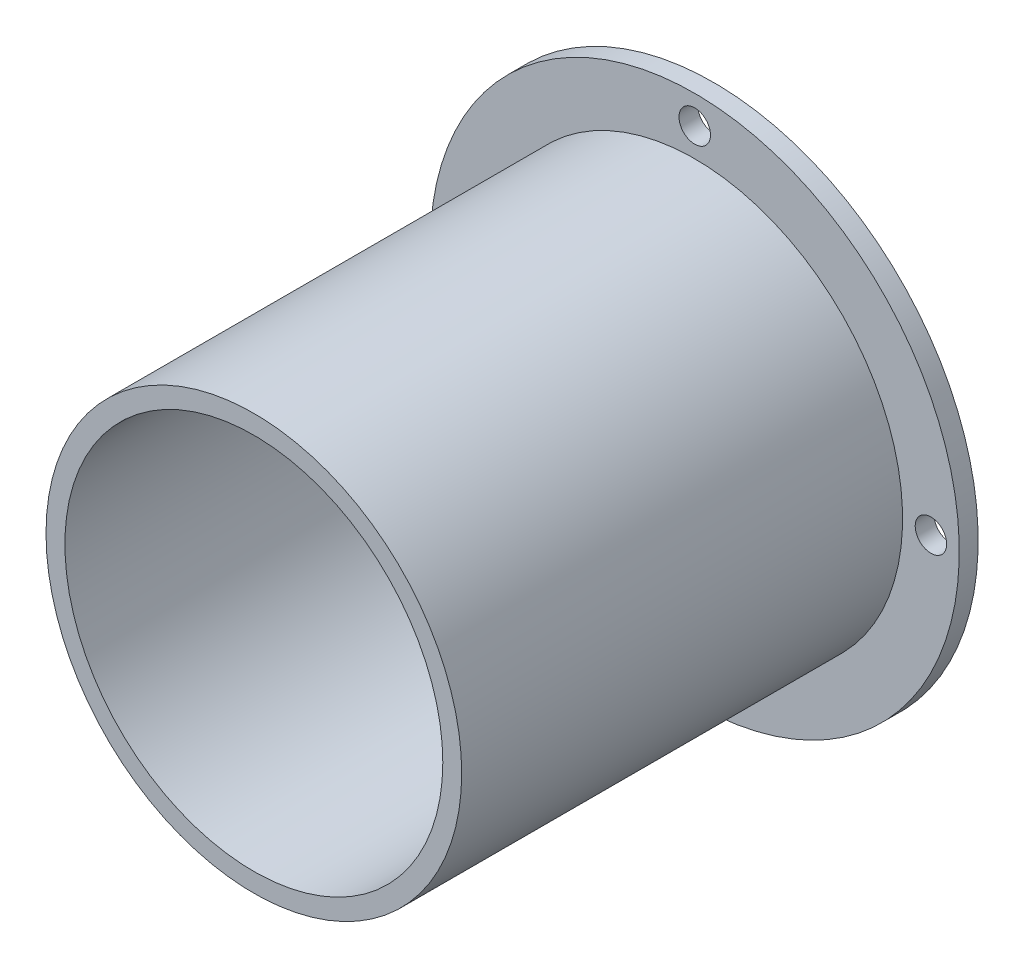
ISO-10303-21;
HEADER;
FILE_DESCRIPTION(('STEP AP214'),'2;1');
FILE_NAME('part.step','',(''),(''),'','','');
FILE_SCHEMA(('AUTOMOTIVE_DESIGN { 1 0 10303 214 1 1 1 1 }'));
ENDSEC;
DATA;
#1=APPLICATION_CONTEXT('core data for automotive mechanical design processes');
#2=APPLICATION_PROTOCOL_DEFINITION('international standard','automotive_design',2000,#1);
#3=PRODUCT_CONTEXT('',#1,'mechanical');
#4=PRODUCT('Part','Part','',(#3));
#5=PRODUCT_RELATED_PRODUCT_CATEGORY('part','',(#4));
#6=PRODUCT_DEFINITION_FORMATION('','',#4);
#7=PRODUCT_DEFINITION_CONTEXT('part definition',#1,'design');
#8=PRODUCT_DEFINITION('design','',#6,#7);
#9=PRODUCT_DEFINITION_SHAPE('','',#8);
#10=(LENGTH_UNIT() NAMED_UNIT(*) SI_UNIT(.MILLI.,.METRE.));
#11=(NAMED_UNIT(*) PLANE_ANGLE_UNIT() SI_UNIT($,.RADIAN.));
#12=(NAMED_UNIT(*) SI_UNIT($,.STERADIAN.) SOLID_ANGLE_UNIT());
#13=UNCERTAINTY_MEASURE_WITH_UNIT(LENGTH_MEASURE(1.E-05),#10,'distance_accuracy_value','');
#14=(GEOMETRIC_REPRESENTATION_CONTEXT(3) GLOBAL_UNCERTAINTY_ASSIGNED_CONTEXT((#13)) GLOBAL_UNIT_ASSIGNED_CONTEXT((#10,
#11,#12)) REPRESENTATION_CONTEXT('',''));
#15=CARTESIAN_POINT('',(0.,0.,0.));
#16=DIRECTION('',(0.,0.,1.));
#17=DIRECTION('',(1.,0.,0.));
#18=AXIS2_PLACEMENT_3D('',#15,#16,#17);
#19=CARTESIAN_POINT('',(0.,0.,-3.5));
#20=DIRECTION('',(0.,0.,-1.));
#21=DIRECTION('',(-1.,0.,0.));
#22=AXIS2_PLACEMENT_3D('',#19,#20,#21);
#23=PLANE('',#22);
#24=CARTESIAN_POINT('',(-9.8556991912404E-13,-18.75,-3.5));
#25=DIRECTION('',(0.,0.,-1.));
#26=DIRECTION('',(-1.,0.,0.));
#27=AXIS2_PLACEMENT_3D('',#24,#25,#26);
#28=CIRCLE('',#27,1.25);
#29=CARTESIAN_POINT('',(-1.25000000000099,-18.75,-3.5));
#30=VERTEX_POINT('',#29);
#31=EDGE_CURVE('E73',#30,#30,#28,.T.);
#32=ORIENTED_EDGE('',*,*,#31,.F.);
#33=EDGE_LOOP('',(#32));
#34=FACE_BOUND('',#33,.T.);
#35=CARTESIAN_POINT('',(0.,18.75,-3.5));
#36=DIRECTION('',(0.,0.,-1.));
#37=DIRECTION('',(-1.,0.,0.));
#38=AXIS2_PLACEMENT_3D('',#35,#36,#37);
#39=CIRCLE('',#38,1.25);
#40=CARTESIAN_POINT('',(-1.25,18.75,-3.5));
#41=VERTEX_POINT('',#40);
#42=EDGE_CURVE('E61',#41,#41,#39,.T.);
#43=ORIENTED_EDGE('',*,*,#42,.F.);
#44=EDGE_LOOP('',(#43));
#45=FACE_BOUND('',#44,.T.);
#46=CARTESIAN_POINT('',(0.,0.,-3.5));
#47=DIRECTION('',(0.,0.,-1.));
#48=DIRECTION('',(-1.,0.,0.));
#49=AXIS2_PLACEMENT_3D('',#46,#47,#48);
#50=CIRCLE('',#49,21.);
#51=CARTESIAN_POINT('',(-21.,0.,-3.5));
#52=VERTEX_POINT('',#51);
#53=EDGE_CURVE('E11',#52,#52,#50,.T.);
#54=ORIENTED_EDGE('',*,*,#53,.T.);
#55=EDGE_LOOP('',(#54));
#56=FACE_BOUND('',#55,.T.);
#57=CARTESIAN_POINT('',(0.,0.,-3.5));
#58=DIRECTION('',(0.,0.,-1.));
#59=DIRECTION('',(-1.,0.,0.));
#60=AXIS2_PLACEMENT_3D('',#57,#58,#59);
#61=CIRCLE('',#60,16.5);
#62=CARTESIAN_POINT('',(-16.5,0.,-3.5));
#63=VERTEX_POINT('',#62);
#64=EDGE_CURVE('E56',#63,#63,#61,.T.);
#65=ORIENTED_EDGE('',*,*,#64,.F.);
#66=EDGE_LOOP('',(#65));
#67=FACE_BOUND('',#66,.T.);
#68=CARTESIAN_POINT('',(-18.7500000000005,4.9278495956202E-13,-3.5));
#69=DIRECTION('',(0.,0.,-1.));
#70=DIRECTION('',(-1.,0.,0.));
#71=AXIS2_PLACEMENT_3D('',#68,#69,#70);
#72=CIRCLE('',#71,1.25);
#73=CARTESIAN_POINT('',(-20.0000000000005,4.9278495956202E-13,-3.5));
#74=VERTEX_POINT('',#73);
#75=EDGE_CURVE('E67',#74,#74,#72,.T.);
#76=ORIENTED_EDGE('',*,*,#75,.F.);
#77=EDGE_LOOP('',(#76));
#78=FACE_BOUND('',#77,.T.);
#79=CARTESIAN_POINT('',(18.7499999999995,-4.95081172310421E-13,-3.5));
#80=DIRECTION('',(0.,0.,-1.));
#81=DIRECTION('',(-1.,0.,0.));
#82=AXIS2_PLACEMENT_3D('',#79,#80,#81);
#83=CIRCLE('',#82,1.25);
#84=CARTESIAN_POINT('',(17.4999999999995,-4.95081172310421E-13,-3.5));
#85=VERTEX_POINT('',#84);
#86=EDGE_CURVE('E79',#85,#85,#83,.T.);
#87=ORIENTED_EDGE('',*,*,#86,.F.);
#88=EDGE_LOOP('',(#87));
#89=FACE_BOUND('',#88,.T.);
#90=ADVANCED_FACE('F45',(#34,#45,#56,#67,#78,#89),#23,.T.);
#91=CARTESIAN_POINT('',(0.,0.,-2.));
#92=DIRECTION('',(0.,0.,-1.));
#93=DIRECTION('',(-1.,0.,0.));
#94=AXIS2_PLACEMENT_3D('',#91,#92,#93);
#95=PLANE('',#94);
#96=CARTESIAN_POINT('',(0.,0.,-2.));
#97=DIRECTION('',(0.,0.,-1.));
#98=DIRECTION('',(-1.,0.,0.));
#99=AXIS2_PLACEMENT_3D('',#96,#97,#98);
#100=CIRCLE('',#99,21.);
#101=CARTESIAN_POINT('',(-21.,0.,-2.));
#102=VERTEX_POINT('',#101);
#103=EDGE_CURVE('E49',#102,#102,#100,.T.);
#104=ORIENTED_EDGE('',*,*,#103,.F.);
#105=EDGE_LOOP('',(#104));
#106=FACE_BOUND('',#105,.T.);
#107=CARTESIAN_POINT('',(0.,0.,-2.));
#108=DIRECTION('',(0.,0.,-1.));
#109=DIRECTION('',(-1.,0.,0.));
#110=AXIS2_PLACEMENT_3D('',#107,#108,#109);
#111=CIRCLE('',#110,16.5);
#112=CARTESIAN_POINT('',(-16.5,0.,-2.));
#113=VERTEX_POINT('',#112);
#114=EDGE_CURVE('E58',#113,#113,#111,.T.);
#115=ORIENTED_EDGE('',*,*,#114,.T.);
#116=EDGE_LOOP('',(#115));
#117=FACE_BOUND('',#116,.T.);
#118=CARTESIAN_POINT('',(0.,18.75,-2.));
#119=DIRECTION('',(0.,0.,-1.));
#120=DIRECTION('',(-1.,0.,0.));
#121=AXIS2_PLACEMENT_3D('',#118,#119,#120);
#122=CIRCLE('',#121,1.25);
#123=CARTESIAN_POINT('',(-1.25,18.75,-2.));
#124=VERTEX_POINT('',#123);
#125=EDGE_CURVE('E64',#124,#124,#122,.T.);
#126=ORIENTED_EDGE('',*,*,#125,.T.);
#127=EDGE_LOOP('',(#126));
#128=FACE_BOUND('',#127,.T.);
#129=CARTESIAN_POINT('',(-18.7500000000005,4.9278495956202E-13,-2.));
#130=DIRECTION('',(0.,0.,-1.));
#131=DIRECTION('',(-1.,0.,0.));
#132=AXIS2_PLACEMENT_3D('',#129,#130,#131);
#133=CIRCLE('',#132,1.25);
#134=CARTESIAN_POINT('',(-20.0000000000005,4.9278495956202E-13,-2.));
#135=VERTEX_POINT('',#134);
#136=EDGE_CURVE('E70',#135,#135,#133,.T.);
#137=ORIENTED_EDGE('',*,*,#136,.T.);
#138=EDGE_LOOP('',(#137));
#139=FACE_BOUND('',#138,.T.);
#140=CARTESIAN_POINT('',(-9.8556991912404E-13,-18.75,-2.));
#141=DIRECTION('',(0.,0.,-1.));
#142=DIRECTION('',(-1.,0.,0.));
#143=AXIS2_PLACEMENT_3D('',#140,#141,#142);
#144=CIRCLE('',#143,1.25);
#145=CARTESIAN_POINT('',(-1.25000000000099,-18.75,-2.));
#146=VERTEX_POINT('',#145);
#147=EDGE_CURVE('E76',#146,#146,#144,.T.);
#148=ORIENTED_EDGE('',*,*,#147,.T.);
#149=EDGE_LOOP('',(#148));
#150=FACE_BOUND('',#149,.T.);
#151=CARTESIAN_POINT('',(18.7499999999995,-4.95081172310421E-13,-2.));
#152=DIRECTION('',(0.,0.,-1.));
#153=DIRECTION('',(-1.,0.,0.));
#154=AXIS2_PLACEMENT_3D('',#151,#152,#153);
#155=CIRCLE('',#154,1.25);
#156=CARTESIAN_POINT('',(17.4999999999995,-4.95081172310421E-13,-2.));
#157=VERTEX_POINT('',#156);
#158=EDGE_CURVE('E82',#157,#157,#155,.T.);
#159=ORIENTED_EDGE('',*,*,#158,.T.);
#160=EDGE_LOOP('',(#159));
#161=FACE_BOUND('',#160,.T.);
#162=ADVANCED_FACE('F92',(#106,#117,#128,#139,#150,#161),#95,.F.);
#163=CARTESIAN_POINT('',(0.,0.,-3.5));
#164=DIRECTION('',(0.,0.,1.));
#165=DIRECTION('',(1.,0.,0.));
#166=AXIS2_PLACEMENT_3D('',#163,#164,#165);
#167=CYLINDRICAL_SURFACE('',#166,21.);
#168=ORIENTED_EDGE('',*,*,#53,.F.);
#169=EDGE_LOOP('',(#168));
#170=FACE_BOUND('',#169,.T.);
#171=ORIENTED_EDGE('',*,*,#103,.T.);
#172=EDGE_LOOP('',(#171));
#173=FACE_BOUND('',#172,.T.);
#174=ADVANCED_FACE('F47',(#170,#173),#167,.T.);
#175=CARTESIAN_POINT('',(0.,0.,-3.5));
#176=DIRECTION('',(0.,0.,1.));
#177=DIRECTION('',(1.,0.,0.));
#178=AXIS2_PLACEMENT_3D('',#175,#176,#177);
#179=CYLINDRICAL_SURFACE('',#178,16.5);
#180=ORIENTED_EDGE('',*,*,#64,.T.);
#181=EDGE_LOOP('',(#180));
#182=FACE_BOUND('',#181,.T.);
#183=ORIENTED_EDGE('',*,*,#114,.F.);
#184=EDGE_LOOP('',(#183));
#185=FACE_BOUND('',#184,.T.);
#186=ADVANCED_FACE('F102',(#182,#185),#179,.F.);
#187=CARTESIAN_POINT('',(0.,18.75,-3.5));
#188=DIRECTION('',(0.,0.,1.));
#189=DIRECTION('',(1.,0.,0.));
#190=AXIS2_PLACEMENT_3D('',#187,#188,#189);
#191=CYLINDRICAL_SURFACE('',#190,1.25);
#192=ORIENTED_EDGE('',*,*,#42,.T.);
#193=EDGE_LOOP('',(#192));
#194=FACE_BOUND('',#193,.T.);
#195=ORIENTED_EDGE('',*,*,#125,.F.);
#196=EDGE_LOOP('',(#195));
#197=FACE_BOUND('',#196,.T.);
#198=ADVANCED_FACE('F105',(#194,#197),#191,.F.);
#199=CARTESIAN_POINT('',(-18.7500000000005,4.9278495956202E-13,-3.5));
#200=DIRECTION('',(0.,0.,1.));
#201=DIRECTION('',(1.,0.,0.));
#202=AXIS2_PLACEMENT_3D('',#199,#200,#201);
#203=CYLINDRICAL_SURFACE('',#202,1.25);
#204=ORIENTED_EDGE('',*,*,#75,.T.);
#205=EDGE_LOOP('',(#204));
#206=FACE_BOUND('',#205,.T.);
#207=ORIENTED_EDGE('',*,*,#136,.F.);
#208=EDGE_LOOP('',(#207));
#209=FACE_BOUND('',#208,.T.);
#210=ADVANCED_FACE('F109',(#206,#209),#203,.F.);
#211=CARTESIAN_POINT('',(-9.8556991912404E-13,-18.75,-3.5));
#212=DIRECTION('',(0.,0.,1.));
#213=DIRECTION('',(1.,0.,0.));
#214=AXIS2_PLACEMENT_3D('',#211,#212,#213);
#215=CYLINDRICAL_SURFACE('',#214,1.25);
#216=ORIENTED_EDGE('',*,*,#31,.T.);
#217=EDGE_LOOP('',(#216));
#218=FACE_BOUND('',#217,.T.);
#219=ORIENTED_EDGE('',*,*,#147,.F.);
#220=EDGE_LOOP('',(#219));
#221=FACE_BOUND('',#220,.T.);
#222=ADVANCED_FACE('F113',(#218,#221),#215,.F.);
#223=CARTESIAN_POINT('',(18.7499999999995,-4.95081172310421E-13,-3.5));
#224=DIRECTION('',(0.,0.,1.));
#225=DIRECTION('',(1.,0.,0.));
#226=AXIS2_PLACEMENT_3D('',#223,#224,#225);
#227=CYLINDRICAL_SURFACE('',#226,1.25);
#228=ORIENTED_EDGE('',*,*,#86,.T.);
#229=EDGE_LOOP('',(#228));
#230=FACE_BOUND('',#229,.T.);
#231=ORIENTED_EDGE('',*,*,#158,.F.);
#232=EDGE_LOOP('',(#231));
#233=FACE_BOUND('',#232,.T.);
#234=ADVANCED_FACE('F88',(#230,#233),#227,.F.);
#235=CLOSED_SHELL('',(#90,#162,#174,#186,#198,#210,#222,#234));
#236=MANIFOLD_SOLID_BREP('B2',#235);
#237=CARTESIAN_POINT('',(0.,0.,0.));
#238=DIRECTION('',(0.,0.,1.));
#239=DIRECTION('',(1.,0.,0.));
#240=AXIS2_PLACEMENT_3D('',#237,#238,#239);
#241=PLANE('',#240);
#242=CARTESIAN_POINT('',(0.,0.,0.));
#243=DIRECTION('',(0.,0.,-1.));
#244=DIRECTION('',(-1.,0.,0.));
#245=AXIS2_PLACEMENT_3D('',#242,#243,#244);
#246=CIRCLE('',#245,2.5);
#247=CARTESIAN_POINT('',(-2.5,0.,0.));
#248=VERTEX_POINT('',#247);
#249=EDGE_CURVE('E212',#248,#248,#246,.T.);
#250=ORIENTED_EDGE('',*,*,#249,.F.);
#251=EDGE_LOOP('',(#250));
#252=FACE_BOUND('',#251,.T.);
#253=CARTESIAN_POINT('',(0.,0.,0.));
#254=DIRECTION('',(0.,0.,-1.));
#255=DIRECTION('',(-1.,0.,0.));
#256=AXIS2_PLACEMENT_3D('',#253,#254,#255);
#257=CIRCLE('',#256,15.);
#258=CARTESIAN_POINT('',(-15.,0.,0.));
#259=VERTEX_POINT('',#258);
#260=EDGE_CURVE('E224',#259,#259,#257,.T.);
#261=ORIENTED_EDGE('',*,*,#260,.T.);
#262=EDGE_LOOP('',(#261));
#263=FACE_BOUND('',#262,.T.);
#264=ADVANCED_FACE('F191',(#252,#263),#241,.F.);
#265=CARTESIAN_POINT('',(0.,0.,33.));
#266=DIRECTION('',(0.,0.,-1.));
#267=DIRECTION('',(-1.,0.,0.));
#268=AXIS2_PLACEMENT_3D('',#265,#266,#267);
#269=CYLINDRICAL_SURFACE('',#268,16.5);
#270=CARTESIAN_POINT('',(0.,0.,33.));
#271=DIRECTION('',(0.,0.,1.));
#272=DIRECTION('',(1.,0.,0.));
#273=AXIS2_PLACEMENT_3D('',#270,#271,#272);
#274=CIRCLE('',#273,16.5);
#275=CARTESIAN_POINT('',(16.5,0.,33.));
#276=VERTEX_POINT('',#275);
#277=EDGE_CURVE('E44',#276,#276,#274,.T.);
#278=ORIENTED_EDGE('',*,*,#277,.F.);
#279=EDGE_LOOP('',(#278));
#280=FACE_BOUND('',#279,.T.);
#281=CARTESIAN_POINT('',(0.,0.,-2.));
#282=DIRECTION('',(0.,0.,-1.));
#283=DIRECTION('',(-1.,0.,0.));
#284=AXIS2_PLACEMENT_3D('',#281,#282,#283);
#285=CIRCLE('',#284,16.5);
#286=CARTESIAN_POINT('',(-16.5,0.,-2.));
#287=VERTEX_POINT('',#286);
#288=EDGE_CURVE('E216',#287,#287,#285,.T.);
#289=ORIENTED_EDGE('',*,*,#288,.F.);
#290=EDGE_LOOP('',(#289));
#291=FACE_BOUND('',#290,.T.);
#292=ADVANCED_FACE('F193',(#280,#291),#269,.T.);
#293=CARTESIAN_POINT('',(0.,0.,33.));
#294=DIRECTION('',(0.,0.,1.));
#295=DIRECTION('',(1.,0.,0.));
#296=AXIS2_PLACEMENT_3D('',#293,#294,#295);
#297=PLANE('',#296);
#298=CARTESIAN_POINT('',(0.,0.,33.));
#299=DIRECTION('',(0.,0.,1.));
#300=DIRECTION('',(1.,0.,0.));
#301=AXIS2_PLACEMENT_3D('',#298,#299,#300);
#302=CIRCLE('',#301,15.);
#303=CARTESIAN_POINT('',(15.,0.,33.));
#304=VERTEX_POINT('',#303);
#305=EDGE_CURVE('E199',#304,#304,#302,.T.);
#306=ORIENTED_EDGE('',*,*,#305,.F.);
#307=EDGE_LOOP('',(#306));
#308=FACE_BOUND('',#307,.T.);
#309=ORIENTED_EDGE('',*,*,#277,.T.);
#310=EDGE_LOOP('',(#309));
#311=FACE_BOUND('',#310,.T.);
#312=ADVANCED_FACE('F253',(#308,#311),#297,.T.);
#313=CARTESIAN_POINT('',(0.,0.,33.));
#314=DIRECTION('',(0.,0.,-1.));
#315=DIRECTION('',(-1.,0.,0.));
#316=AXIS2_PLACEMENT_3D('',#313,#314,#315);
#317=CYLINDRICAL_SURFACE('',#316,15.);
#318=ORIENTED_EDGE('',*,*,#305,.T.);
#319=EDGE_LOOP('',(#318));
#320=FACE_BOUND('',#319,.T.);
#321=CARTESIAN_POINT('',(0.,0.,1.5));
#322=DIRECTION('',(0.,0.,1.));
#323=DIRECTION('',(1.,0.,0.));
#324=AXIS2_PLACEMENT_3D('',#321,#322,#323);
#325=CIRCLE('',#324,15.);
#326=CARTESIAN_POINT('',(15.,0.,1.5));
#327=VERTEX_POINT('',#326);
#328=EDGE_CURVE('E204',#327,#327,#325,.T.);
#329=ORIENTED_EDGE('',*,*,#328,.F.);
#330=EDGE_LOOP('',(#329));
#331=FACE_BOUND('',#330,.T.);
#332=ADVANCED_FACE('F260',(#320,#331),#317,.F.);
#333=CARTESIAN_POINT('',(0.,0.,1.5));
#334=DIRECTION('',(0.,0.,1.));
#335=DIRECTION('',(1.,0.,0.));
#336=AXIS2_PLACEMENT_3D('',#333,#334,#335);
#337=PLANE('',#336);
#338=CARTESIAN_POINT('',(0.,0.,1.5));
#339=DIRECTION('',(0.,0.,-1.));
#340=DIRECTION('',(-1.,0.,0.));
#341=AXIS2_PLACEMENT_3D('',#338,#339,#340);
#342=CIRCLE('',#341,2.5);
#343=CARTESIAN_POINT('',(-2.5,0.,1.5));
#344=VERTEX_POINT('',#343);
#345=EDGE_CURVE('E209',#344,#344,#342,.T.);
#346=ORIENTED_EDGE('',*,*,#345,.T.);
#347=EDGE_LOOP('',(#346));
#348=FACE_BOUND('',#347,.T.);
#349=ORIENTED_EDGE('',*,*,#328,.T.);
#350=EDGE_LOOP('',(#349));
#351=FACE_BOUND('',#350,.T.);
#352=ADVANCED_FACE('F245',(#348,#351),#337,.T.);
#353=CARTESIAN_POINT('',(0.,0.,1.5));
#354=DIRECTION('',(0.,0.,-1.));
#355=DIRECTION('',(-1.,0.,0.));
#356=AXIS2_PLACEMENT_3D('',#353,#354,#355);
#357=CYLINDRICAL_SURFACE('',#356,2.5);
#358=ORIENTED_EDGE('',*,*,#345,.F.);
#359=EDGE_LOOP('',(#358));
#360=FACE_BOUND('',#359,.T.);
#361=ORIENTED_EDGE('',*,*,#249,.T.);
#362=EDGE_LOOP('',(#361));
#363=FACE_BOUND('',#362,.T.);
#364=ADVANCED_FACE('F237',(#360,#363),#357,.F.);
#365=CARTESIAN_POINT('',(0.,0.,-2.));
#366=DIRECTION('',(0.,0.,-1.));
#367=DIRECTION('',(-1.,0.,0.));
#368=AXIS2_PLACEMENT_3D('',#365,#366,#367);
#369=PLANE('',#368);
#370=ORIENTED_EDGE('',*,*,#288,.T.);
#371=EDGE_LOOP('',(#370));
#372=FACE_BOUND('',#371,.T.);
#373=CARTESIAN_POINT('',(0.,0.,-2.));
#374=DIRECTION('',(0.,0.,-1.));
#375=DIRECTION('',(-1.,0.,0.));
#376=AXIS2_PLACEMENT_3D('',#373,#374,#375);
#377=CIRCLE('',#376,15.);
#378=CARTESIAN_POINT('',(-15.,0.,-2.));
#379=VERTEX_POINT('',#378);
#380=EDGE_CURVE('E223',#379,#379,#377,.T.);
#381=ORIENTED_EDGE('',*,*,#380,.F.);
#382=EDGE_LOOP('',(#381));
#383=FACE_BOUND('',#382,.T.);
#384=ADVANCED_FACE('F235',(#372,#383),#369,.T.);
#385=CARTESIAN_POINT('',(0.,0.,-2.));
#386=DIRECTION('',(0.,0.,1.));
#387=DIRECTION('',(1.,0.,0.));
#388=AXIS2_PLACEMENT_3D('',#385,#386,#387);
#389=CYLINDRICAL_SURFACE('',#388,15.);
#390=ORIENTED_EDGE('',*,*,#380,.T.);
#391=EDGE_LOOP('',(#390));
#392=FACE_BOUND('',#391,.T.);
#393=ORIENTED_EDGE('',*,*,#260,.F.);
#394=EDGE_LOOP('',(#393));
#395=FACE_BOUND('',#394,.T.);
#396=ADVANCED_FACE('F232',(#392,#395),#389,.F.);
#397=CLOSED_SHELL('',(#264,#292,#312,#332,#352,#364,#384,#396));
#398=MANIFOLD_SOLID_BREP('B6',#397);
#399=ADVANCED_BREP_SHAPE_REPRESENTATION('',(#18,#236,#398),#14);
#400=SHAPE_DEFINITION_REPRESENTATION(#9,#399);
ENDSEC;
END-ISO-10303-21;
